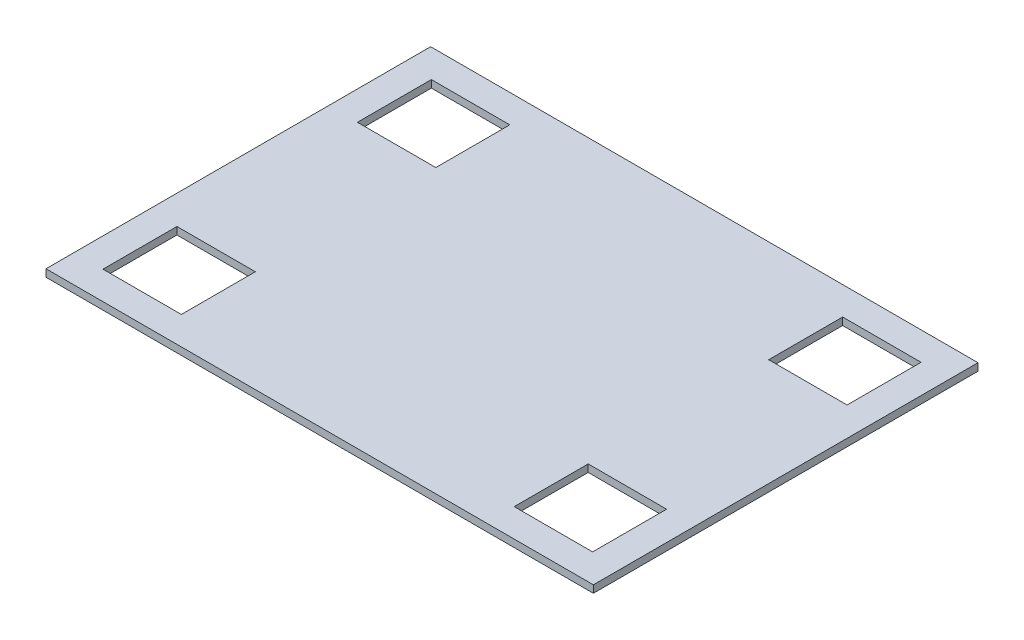
ISO-10303-21;
HEADER;
FILE_DESCRIPTION(('STEP AP214'),'2;1');
FILE_NAME('part.step','',(''),(''),'','','');
FILE_SCHEMA(('AUTOMOTIVE_DESIGN { 1 0 10303 214 1 1 1 1 }'));
ENDSEC;
DATA;
#1=APPLICATION_CONTEXT('core data for automotive mechanical design processes');
#2=APPLICATION_PROTOCOL_DEFINITION('international standard','automotive_design',2000,#1);
#3=PRODUCT_CONTEXT('',#1,'mechanical');
#4=PRODUCT('Part','Part','',(#3));
#5=PRODUCT_RELATED_PRODUCT_CATEGORY('part','',(#4));
#6=PRODUCT_DEFINITION_FORMATION('','',#4);
#7=PRODUCT_DEFINITION_CONTEXT('part definition',#1,'design');
#8=PRODUCT_DEFINITION('design','',#6,#7);
#9=PRODUCT_DEFINITION_SHAPE('','',#8);
#10=(LENGTH_UNIT() NAMED_UNIT(*) SI_UNIT(.MILLI.,.METRE.));
#11=(NAMED_UNIT(*) PLANE_ANGLE_UNIT() SI_UNIT($,.RADIAN.));
#12=(NAMED_UNIT(*) SI_UNIT($,.STERADIAN.) SOLID_ANGLE_UNIT());
#13=UNCERTAINTY_MEASURE_WITH_UNIT(LENGTH_MEASURE(1.E-05),#10,'distance_accuracy_value','');
#14=(GEOMETRIC_REPRESENTATION_CONTEXT(3) GLOBAL_UNCERTAINTY_ASSIGNED_CONTEXT((#13)) GLOBAL_UNIT_ASSIGNED_CONTEXT((#10,
#11,#12)) REPRESENTATION_CONTEXT('',''));
#15=CARTESIAN_POINT('',(0.,0.,0.));
#16=DIRECTION('',(0.,0.,1.));
#17=DIRECTION('',(1.,0.,0.));
#18=AXIS2_PLACEMENT_3D('',#15,#16,#17);
#19=CARTESIAN_POINT('',(0.,5.,0.));
#20=DIRECTION('',(0.,1.,0.));
#21=DIRECTION('',(0.,0.,1.));
#22=AXIS2_PLACEMENT_3D('',#19,#20,#21);
#23=PLANE('',#22);
#24=DIRECTION('',(1.,0.,0.));
#25=VECTOR('',#24,1.);
#26=CARTESIAN_POINT('',(0.,5.,111.));
#27=LINE('',#26,#25);
#28=CARTESIAN_POINT('',(-165.5,5.,111.));
#29=VERTEX_POINT('',#28);
#30=CARTESIAN_POINT('',(-112.5,5.,111.));
#31=VERTEX_POINT('',#30);
#32=EDGE_CURVE('E322',#29,#31,#27,.T.);
#33=ORIENTED_EDGE('',*,*,#32,.F.);
#34=DIRECTION('',(0.,0.,1.));
#35=VECTOR('',#34,1.);
#36=CARTESIAN_POINT('',(-165.5,5.,0.));
#37=LINE('',#36,#35);
#38=CARTESIAN_POINT('',(-165.5,5.,61.));
#39=VERTEX_POINT('',#38);
#40=EDGE_CURVE('E303',#39,#29,#37,.T.);
#41=ORIENTED_EDGE('',*,*,#40,.F.);
#42=DIRECTION('',(1.,0.,0.));
#43=VECTOR('',#42,1.);
#44=CARTESIAN_POINT('',(0.,5.,61.));
#45=LINE('',#44,#43);
#46=CARTESIAN_POINT('',(-112.5,5.,61.));
#47=VERTEX_POINT('',#46);
#48=EDGE_CURVE('E315',#39,#47,#45,.T.);
#49=ORIENTED_EDGE('',*,*,#48,.T.);
#50=DIRECTION('',(0.,0.,-1.));
#51=VECTOR('',#50,1.);
#52=CARTESIAN_POINT('',(-112.5,5.,0.));
#53=LINE('',#52,#51);
#54=EDGE_CURVE('E319',#31,#47,#53,.T.);
#55=ORIENTED_EDGE('',*,*,#54,.F.);
#56=EDGE_LOOP('',(#33,#41,#49,#55));
#57=FACE_BOUND('',#56,.T.);
#58=DIRECTION('',(0.,0.,-1.));
#59=VECTOR('',#58,1.);
#60=CARTESIAN_POINT('',(185.,5.,-130.));
#61=LINE('',#60,#59);
#62=CARTESIAN_POINT('',(185.,5.,130.));
#63=VERTEX_POINT('',#62);
#64=CARTESIAN_POINT('',(185.,5.,-130.));
#65=VERTEX_POINT('',#64);
#66=EDGE_CURVE('E368',#63,#65,#61,.T.);
#67=ORIENTED_EDGE('',*,*,#66,.T.);
#68=DIRECTION('',(-1.,0.,0.));
#69=VECTOR('',#68,1.);
#70=CARTESIAN_POINT('',(-185.,5.,-130.));
#71=LINE('',#70,#69);
#72=CARTESIAN_POINT('',(-185.,5.,-130.));
#73=VERTEX_POINT('',#72);
#74=EDGE_CURVE('E372',#65,#73,#71,.T.);
#75=ORIENTED_EDGE('',*,*,#74,.T.);
#76=DIRECTION('',(0.,0.,1.));
#77=VECTOR('',#76,1.);
#78=CARTESIAN_POINT('',(-185.,5.,-130.));
#79=LINE('',#78,#77);
#80=CARTESIAN_POINT('',(-185.,5.,130.));
#81=VERTEX_POINT('',#80);
#82=EDGE_CURVE('E376',#73,#81,#79,.T.);
#83=ORIENTED_EDGE('',*,*,#82,.T.);
#84=DIRECTION('',(1.,0.,0.));
#85=VECTOR('',#84,1.);
#86=CARTESIAN_POINT('',(-185.,5.,130.));
#87=LINE('',#86,#85);
#88=EDGE_CURVE('E379',#81,#63,#87,.T.);
#89=ORIENTED_EDGE('',*,*,#88,.T.);
#90=EDGE_LOOP('',(#67,#75,#83,#89));
#91=FACE_BOUND('',#90,.T.);
#92=DIRECTION('',(0.,0.,-1.));
#93=VECTOR('',#92,1.);
#94=CARTESIAN_POINT('',(165.5,5.,0.));
#95=LINE('',#94,#93);
#96=CARTESIAN_POINT('',(165.5,5.,-61.));
#97=VERTEX_POINT('',#96);
#98=CARTESIAN_POINT('',(165.5,5.,-111.));
#99=VERTEX_POINT('',#98);
#100=EDGE_CURVE('E330',#97,#99,#95,.T.);
#101=ORIENTED_EDGE('',*,*,#100,.F.);
#102=DIRECTION('',(-1.,0.,0.));
#103=VECTOR('',#102,1.);
#104=CARTESIAN_POINT('',(0.,5.,-61.));
#105=LINE('',#104,#103);
#106=CARTESIAN_POINT('',(112.5,5.,-61.));
#107=VERTEX_POINT('',#106);
#108=EDGE_CURVE('E333',#97,#107,#105,.T.);
#109=ORIENTED_EDGE('',*,*,#108,.T.);
#110=DIRECTION('',(0.,0.,1.));
#111=VECTOR('',#110,1.);
#112=CARTESIAN_POINT('',(112.5,5.,0.));
#113=LINE('',#112,#111);
#114=CARTESIAN_POINT('',(112.5,5.,-111.));
#115=VERTEX_POINT('',#114);
#116=EDGE_CURVE('E325',#115,#107,#113,.T.);
#117=ORIENTED_EDGE('',*,*,#116,.F.);
#118=DIRECTION('',(-1.,0.,0.));
#119=VECTOR('',#118,1.);
#120=CARTESIAN_POINT('',(0.,5.,-111.));
#121=LINE('',#120,#119);
#122=EDGE_CURVE('E194',#99,#115,#121,.T.);
#123=ORIENTED_EDGE('',*,*,#122,.F.);
#124=EDGE_LOOP('',(#101,#109,#117,#123));
#125=FACE_BOUND('',#124,.T.);
#126=DIRECTION('',(-1.,0.,0.));
#127=VECTOR('',#126,1.);
#128=CARTESIAN_POINT('',(0.,5.,111.));
#129=LINE('',#128,#127);
#130=CARTESIAN_POINT('',(165.5,5.,111.));
#131=VERTEX_POINT('',#130);
#132=CARTESIAN_POINT('',(112.5,5.,111.));
#133=VERTEX_POINT('',#132);
#134=EDGE_CURVE('E344',#131,#133,#129,.T.);
#135=ORIENTED_EDGE('',*,*,#134,.T.);
#136=DIRECTION('',(0.,0.,-1.));
#137=VECTOR('',#136,1.);
#138=CARTESIAN_POINT('',(112.5,5.,0.));
#139=LINE('',#138,#137);
#140=CARTESIAN_POINT('',(112.5,5.,61.));
#141=VERTEX_POINT('',#140);
#142=EDGE_CURVE('E348',#133,#141,#139,.T.);
#143=ORIENTED_EDGE('',*,*,#142,.T.);
#144=DIRECTION('',(-1.,0.,0.));
#145=VECTOR('',#144,1.);
#146=CARTESIAN_POINT('',(0.,5.,61.));
#147=LINE('',#146,#145);
#148=CARTESIAN_POINT('',(165.5,5.,61.));
#149=VERTEX_POINT('',#148);
#150=EDGE_CURVE('E337',#149,#141,#147,.T.);
#151=ORIENTED_EDGE('',*,*,#150,.F.);
#152=DIRECTION('',(0.,0.,1.));
#153=VECTOR('',#152,1.);
#154=CARTESIAN_POINT('',(165.5,5.,0.));
#155=LINE('',#154,#153);
#156=EDGE_CURVE('E340',#149,#131,#155,.T.);
#157=ORIENTED_EDGE('',*,*,#156,.T.);
#158=EDGE_LOOP('',(#135,#143,#151,#157));
#159=FACE_BOUND('',#158,.T.);
#160=DIRECTION('',(1.,0.,0.));
#161=VECTOR('',#160,1.);
#162=CARTESIAN_POINT('',(0.,5.,-111.));
#163=LINE('',#162,#161);
#164=CARTESIAN_POINT('',(-165.5,5.,-111.));
#165=VERTEX_POINT('',#164);
#166=CARTESIAN_POINT('',(-112.5,5.,-111.));
#167=VERTEX_POINT('',#166);
#168=EDGE_CURVE('E359',#165,#167,#163,.T.);
#169=ORIENTED_EDGE('',*,*,#168,.T.);
#170=DIRECTION('',(0.,0.,1.));
#171=VECTOR('',#170,1.);
#172=CARTESIAN_POINT('',(-112.5,5.,0.));
#173=LINE('',#172,#171);
#174=CARTESIAN_POINT('',(-112.5,5.,-61.));
#175=VERTEX_POINT('',#174);
#176=EDGE_CURVE('E363',#167,#175,#173,.T.);
#177=ORIENTED_EDGE('',*,*,#176,.T.);
#178=DIRECTION('',(1.,0.,0.));
#179=VECTOR('',#178,1.);
#180=CARTESIAN_POINT('',(0.,5.,-61.));
#181=LINE('',#180,#179);
#182=CARTESIAN_POINT('',(-165.5,5.,-61.));
#183=VERTEX_POINT('',#182);
#184=EDGE_CURVE('E352',#183,#175,#181,.T.);
#185=ORIENTED_EDGE('',*,*,#184,.F.);
#186=DIRECTION('',(0.,0.,-1.));
#187=VECTOR('',#186,1.);
#188=CARTESIAN_POINT('',(-165.5,5.,0.));
#189=LINE('',#188,#187);
#190=EDGE_CURVE('E355',#183,#165,#189,.T.);
#191=ORIENTED_EDGE('',*,*,#190,.T.);
#192=EDGE_LOOP('',(#169,#177,#185,#191));
#193=FACE_BOUND('',#192,.T.);
#194=ADVANCED_FACE('F48',(#57,#91,#125,#159,#193),#23,.T.);
#195=CARTESIAN_POINT('',(0.,0.,0.));
#196=DIRECTION('',(0.,1.,0.));
#197=DIRECTION('',(0.,0.,1.));
#198=AXIS2_PLACEMENT_3D('',#195,#196,#197);
#199=PLANE('',#198);
#200=DIRECTION('',(0.,0.,1.));
#201=VECTOR('',#200,1.);
#202=CARTESIAN_POINT('',(112.5,0.,0.));
#203=LINE('',#202,#201);
#204=CARTESIAN_POINT('',(112.5,0.,61.));
#205=VERTEX_POINT('',#204);
#206=CARTESIAN_POINT('',(112.5,0.,111.));
#207=VERTEX_POINT('',#206);
#208=EDGE_CURVE('E226',#205,#207,#203,.T.);
#209=ORIENTED_EDGE('',*,*,#208,.T.);
#210=DIRECTION('',(1.,0.,0.));
#211=VECTOR('',#210,1.);
#212=CARTESIAN_POINT('',(0.,0.,111.));
#213=LINE('',#212,#211);
#214=CARTESIAN_POINT('',(165.5,0.,111.));
#215=VERTEX_POINT('',#214);
#216=EDGE_CURVE('E270',#207,#215,#213,.T.);
#217=ORIENTED_EDGE('',*,*,#216,.T.);
#218=DIRECTION('',(0.,0.,-1.));
#219=VECTOR('',#218,1.);
#220=CARTESIAN_POINT('',(165.5,0.,0.));
#221=LINE('',#220,#219);
#222=CARTESIAN_POINT('',(165.5,0.,61.));
#223=VERTEX_POINT('',#222);
#224=EDGE_CURVE('E266',#215,#223,#221,.T.);
#225=ORIENTED_EDGE('',*,*,#224,.T.);
#226=DIRECTION('',(1.,0.,0.));
#227=VECTOR('',#226,1.);
#228=CARTESIAN_POINT('',(0.,0.,61.));
#229=LINE('',#228,#227);
#230=EDGE_CURVE('E263',#205,#223,#229,.T.);
#231=ORIENTED_EDGE('',*,*,#230,.F.);
#232=EDGE_LOOP('',(#209,#217,#225,#231));
#233=FACE_BOUND('',#232,.T.);
#234=DIRECTION('',(0.,0.,-1.));
#235=VECTOR('',#234,1.);
#236=CARTESIAN_POINT('',(185.,0.,-130.));
#237=LINE('',#236,#235);
#238=CARTESIAN_POINT('',(185.,0.,130.));
#239=VERTEX_POINT('',#238);
#240=CARTESIAN_POINT('',(185.,0.,-130.));
#241=VERTEX_POINT('',#240);
#242=EDGE_CURVE('E367',#239,#241,#237,.T.);
#243=ORIENTED_EDGE('',*,*,#242,.F.);
#244=DIRECTION('',(1.,0.,0.));
#245=VECTOR('',#244,1.);
#246=CARTESIAN_POINT('',(-185.,0.,130.));
#247=LINE('',#246,#245);
#248=CARTESIAN_POINT('',(-185.,0.,130.));
#249=VERTEX_POINT('',#248);
#250=EDGE_CURVE('E373',#249,#239,#247,.T.);
#251=ORIENTED_EDGE('',*,*,#250,.F.);
#252=DIRECTION('',(0.,0.,1.));
#253=VECTOR('',#252,1.);
#254=CARTESIAN_POINT('',(-185.,0.,-130.));
#255=LINE('',#254,#253);
#256=CARTESIAN_POINT('',(-185.,0.,-130.));
#257=VERTEX_POINT('',#256);
#258=EDGE_CURVE('E389',#257,#249,#255,.T.);
#259=ORIENTED_EDGE('',*,*,#258,.F.);
#260=DIRECTION('',(-1.,0.,0.));
#261=VECTOR('',#260,1.);
#262=CARTESIAN_POINT('',(-185.,0.,-130.));
#263=LINE('',#262,#261);
#264=EDGE_CURVE('E386',#241,#257,#263,.T.);
#265=ORIENTED_EDGE('',*,*,#264,.F.);
#266=EDGE_LOOP('',(#243,#251,#259,#265));
#267=FACE_BOUND('',#266,.T.);
#268=DIRECTION('',(0.,0.,-1.));
#269=VECTOR('',#268,1.);
#270=CARTESIAN_POINT('',(-165.5,0.,0.));
#271=LINE('',#270,#269);
#272=CARTESIAN_POINT('',(-165.5,0.,111.));
#273=VERTEX_POINT('',#272);
#274=CARTESIAN_POINT('',(-165.5,0.,61.));
#275=VERTEX_POINT('',#274);
#276=EDGE_CURVE('E287',#273,#275,#271,.T.);
#277=ORIENTED_EDGE('',*,*,#276,.F.);
#278=DIRECTION('',(-1.,0.,0.));
#279=VECTOR('',#278,1.);
#280=CARTESIAN_POINT('',(0.,0.,111.));
#281=LINE('',#280,#279);
#282=CARTESIAN_POINT('',(-112.5,0.,111.));
#283=VERTEX_POINT('',#282);
#284=EDGE_CURVE('E251',#283,#273,#281,.T.);
#285=ORIENTED_EDGE('',*,*,#284,.F.);
#286=DIRECTION('',(0.,0.,1.));
#287=VECTOR('',#286,1.);
#288=CARTESIAN_POINT('',(-112.5,0.,0.));
#289=LINE('',#288,#287);
#290=CARTESIAN_POINT('',(-112.5,0.,61.));
#291=VERTEX_POINT('',#290);
#292=EDGE_CURVE('E295',#291,#283,#289,.T.);
#293=ORIENTED_EDGE('',*,*,#292,.F.);
#294=DIRECTION('',(-1.,0.,0.));
#295=VECTOR('',#294,1.);
#296=CARTESIAN_POINT('',(0.,0.,61.));
#297=LINE('',#296,#295);
#298=EDGE_CURVE('E291',#291,#275,#297,.T.);
#299=ORIENTED_EDGE('',*,*,#298,.T.);
#300=EDGE_LOOP('',(#277,#285,#293,#299));
#301=FACE_BOUND('',#300,.T.);
#302=DIRECTION('',(1.,0.,0.));
#303=VECTOR('',#302,1.);
#304=CARTESIAN_POINT('',(0.,0.,-61.));
#305=LINE('',#304,#303);
#306=CARTESIAN_POINT('',(112.5,0.,-61.));
#307=VERTEX_POINT('',#306);
#308=CARTESIAN_POINT('',(165.5,0.,-61.));
#309=VERTEX_POINT('',#308);
#310=EDGE_CURVE('E209',#307,#309,#305,.T.);
#311=ORIENTED_EDGE('',*,*,#310,.T.);
#312=DIRECTION('',(0.,0.,1.));
#313=VECTOR('',#312,1.);
#314=CARTESIAN_POINT('',(165.5,0.,0.));
#315=LINE('',#314,#313);
#316=CARTESIAN_POINT('',(165.5,0.,-111.));
#317=VERTEX_POINT('',#316);
#318=EDGE_CURVE('E214',#317,#309,#315,.T.);
#319=ORIENTED_EDGE('',*,*,#318,.F.);
#320=DIRECTION('',(1.,0.,0.));
#321=VECTOR('',#320,1.);
#322=CARTESIAN_POINT('',(0.,0.,-111.));
#323=LINE('',#322,#321);
#324=CARTESIAN_POINT('',(112.5,0.,-111.));
#325=VERTEX_POINT('',#324);
#326=EDGE_CURVE('E191',#325,#317,#323,.T.);
#327=ORIENTED_EDGE('',*,*,#326,.F.);
#328=DIRECTION('',(0.,0.,-1.));
#329=VECTOR('',#328,1.);
#330=CARTESIAN_POINT('',(112.5,0.,0.));
#331=LINE('',#330,#329);
#332=EDGE_CURVE('E203',#307,#325,#331,.T.);
#333=ORIENTED_EDGE('',*,*,#332,.F.);
#334=EDGE_LOOP('',(#311,#319,#327,#333));
#335=FACE_BOUND('',#334,.T.);
#336=DIRECTION('',(0.,0.,-1.));
#337=VECTOR('',#336,1.);
#338=CARTESIAN_POINT('',(-112.5,0.,0.));
#339=LINE('',#338,#337);
#340=CARTESIAN_POINT('',(-112.5,0.,-61.));
#341=VERTEX_POINT('',#340);
#342=CARTESIAN_POINT('',(-112.5,0.,-111.));
#343=VERTEX_POINT('',#342);
#344=EDGE_CURVE('E231',#341,#343,#339,.T.);
#345=ORIENTED_EDGE('',*,*,#344,.T.);
#346=DIRECTION('',(-1.,0.,0.));
#347=VECTOR('',#346,1.);
#348=CARTESIAN_POINT('',(0.,0.,-111.));
#349=LINE('',#348,#347);
#350=CARTESIAN_POINT('',(-165.5,0.,-111.));
#351=VERTEX_POINT('',#350);
#352=EDGE_CURVE('E243',#343,#351,#349,.T.);
#353=ORIENTED_EDGE('',*,*,#352,.T.);
#354=DIRECTION('',(0.,0.,1.));
#355=VECTOR('',#354,1.);
#356=CARTESIAN_POINT('',(-165.5,0.,0.));
#357=LINE('',#356,#355);
#358=CARTESIAN_POINT('',(-165.5,0.,-61.));
#359=VERTEX_POINT('',#358);
#360=EDGE_CURVE('E239',#351,#359,#357,.T.);
#361=ORIENTED_EDGE('',*,*,#360,.T.);
#362=DIRECTION('',(-1.,0.,0.));
#363=VECTOR('',#362,1.);
#364=CARTESIAN_POINT('',(0.,0.,-61.));
#365=LINE('',#364,#363);
#366=EDGE_CURVE('E235',#341,#359,#365,.T.);
#367=ORIENTED_EDGE('',*,*,#366,.F.);
#368=EDGE_LOOP('',(#345,#353,#361,#367));
#369=FACE_BOUND('',#368,.T.);
#370=ADVANCED_FACE('F211',(#233,#267,#301,#335,#369),#199,.F.);
#371=CARTESIAN_POINT('',(185.,5.,-130.));
#372=DIRECTION('',(-1.,0.,0.));
#373=DIRECTION('',(0.,0.,1.));
#374=AXIS2_PLACEMENT_3D('',#371,#372,#373);
#375=PLANE('',#374);
#376=ORIENTED_EDGE('',*,*,#242,.T.);
#377=DIRECTION('',(0.,-1.,0.));
#378=VECTOR('',#377,1.);
#379=CARTESIAN_POINT('',(185.,5.,-130.));
#380=LINE('',#379,#378);
#381=EDGE_CURVE('E11',#65,#241,#380,.T.);
#382=ORIENTED_EDGE('',*,*,#381,.F.);
#383=ORIENTED_EDGE('',*,*,#66,.F.);
#384=DIRECTION('',(0.,-1.,0.));
#385=VECTOR('',#384,1.);
#386=CARTESIAN_POINT('',(185.,5.,130.));
#387=LINE('',#386,#385);
#388=EDGE_CURVE('E382',#63,#239,#387,.T.);
#389=ORIENTED_EDGE('',*,*,#388,.T.);
#390=EDGE_LOOP('',(#376,#382,#383,#389));
#391=FACE_BOUND('',#390,.T.);
#392=ADVANCED_FACE('F50',(#391),#375,.F.);
#393=CARTESIAN_POINT('',(-185.,5.,-130.));
#394=DIRECTION('',(0.,0.,1.));
#395=DIRECTION('',(1.,0.,0.));
#396=AXIS2_PLACEMENT_3D('',#393,#394,#395);
#397=PLANE('',#396);
#398=ORIENTED_EDGE('',*,*,#264,.T.);
#399=DIRECTION('',(0.,-1.,0.));
#400=VECTOR('',#399,1.);
#401=CARTESIAN_POINT('',(-185.,5.,-130.));
#402=LINE('',#401,#400);
#403=EDGE_CURVE('E57',#73,#257,#402,.T.);
#404=ORIENTED_EDGE('',*,*,#403,.F.);
#405=ORIENTED_EDGE('',*,*,#74,.F.);
#406=ORIENTED_EDGE('',*,*,#381,.T.);
#407=EDGE_LOOP('',(#398,#404,#405,#406));
#408=FACE_BOUND('',#407,.T.);
#409=ADVANCED_FACE('F424',(#408),#397,.F.);
#410=CARTESIAN_POINT('',(-185.,5.,-130.));
#411=DIRECTION('',(1.,0.,0.));
#412=DIRECTION('',(0.,0.,-1.));
#413=AXIS2_PLACEMENT_3D('',#410,#411,#412);
#414=PLANE('',#413);
#415=ORIENTED_EDGE('',*,*,#258,.T.);
#416=DIRECTION('',(0.,-1.,0.));
#417=VECTOR('',#416,1.);
#418=CARTESIAN_POINT('',(-185.,5.,130.));
#419=LINE('',#418,#417);
#420=EDGE_CURVE('E397',#81,#249,#419,.T.);
#421=ORIENTED_EDGE('',*,*,#420,.F.);
#422=ORIENTED_EDGE('',*,*,#82,.F.);
#423=ORIENTED_EDGE('',*,*,#403,.T.);
#424=EDGE_LOOP('',(#415,#421,#422,#423));
#425=FACE_BOUND('',#424,.T.);
#426=ADVANCED_FACE('F408',(#425),#414,.F.);
#427=CARTESIAN_POINT('',(-185.,5.,130.));
#428=DIRECTION('',(0.,0.,-1.));
#429=DIRECTION('',(-1.,0.,0.));
#430=AXIS2_PLACEMENT_3D('',#427,#428,#429);
#431=PLANE('',#430);
#432=ORIENTED_EDGE('',*,*,#250,.T.);
#433=ORIENTED_EDGE('',*,*,#388,.F.);
#434=ORIENTED_EDGE('',*,*,#88,.F.);
#435=ORIENTED_EDGE('',*,*,#420,.T.);
#436=EDGE_LOOP('',(#432,#433,#434,#435));
#437=FACE_BOUND('',#436,.T.);
#438=ADVANCED_FACE('F417',(#437),#431,.F.);
#439=CARTESIAN_POINT('',(0.,10.,111.));
#440=DIRECTION('',(0.,0.,1.));
#441=DIRECTION('',(1.,0.,0.));
#442=AXIS2_PLACEMENT_3D('',#439,#440,#441);
#443=PLANE('',#442);
#444=ORIENTED_EDGE('',*,*,#32,.T.);
#445=DIRECTION('',(0.,-1.,0.));
#446=VECTOR('',#445,1.);
#447=CARTESIAN_POINT('',(-112.5,10.,111.));
#448=LINE('',#447,#446);
#449=EDGE_CURVE('E300',#31,#283,#448,.T.);
#450=ORIENTED_EDGE('',*,*,#449,.T.);
#451=ORIENTED_EDGE('',*,*,#284,.T.);
#452=DIRECTION('',(0.,-1.,0.));
#453=VECTOR('',#452,1.);
#454=CARTESIAN_POINT('',(-165.5,10.,111.));
#455=LINE('',#454,#453);
#456=EDGE_CURVE('E299',#29,#273,#455,.T.);
#457=ORIENTED_EDGE('',*,*,#456,.F.);
#458=EDGE_LOOP('',(#444,#450,#451,#457));
#459=FACE_BOUND('',#458,.T.);
#460=ADVANCED_FACE('F441',(#459),#443,.F.);
#461=CARTESIAN_POINT('',(-112.5,10.,0.));
#462=DIRECTION('',(1.,0.,0.));
#463=DIRECTION('',(0.,0.,-1.));
#464=AXIS2_PLACEMENT_3D('',#461,#462,#463);
#465=PLANE('',#464);
#466=ORIENTED_EDGE('',*,*,#54,.T.);
#467=DIRECTION('',(0.,-1.,0.));
#468=VECTOR('',#467,1.);
#469=CARTESIAN_POINT('',(-112.5,10.,61.));
#470=LINE('',#469,#468);
#471=EDGE_CURVE('E304',#47,#291,#470,.T.);
#472=ORIENTED_EDGE('',*,*,#471,.T.);
#473=ORIENTED_EDGE('',*,*,#292,.T.);
#474=ORIENTED_EDGE('',*,*,#449,.F.);
#475=EDGE_LOOP('',(#466,#472,#473,#474));
#476=FACE_BOUND('',#475,.T.);
#477=ADVANCED_FACE('F448',(#476),#465,.F.);
#478=CARTESIAN_POINT('',(0.,10.,61.));
#479=DIRECTION('',(0.,0.,1.));
#480=DIRECTION('',(1.,0.,0.));
#481=AXIS2_PLACEMENT_3D('',#478,#479,#480);
#482=PLANE('',#481);
#483=DIRECTION('',(0.,-1.,0.));
#484=VECTOR('',#483,1.);
#485=CARTESIAN_POINT('',(-165.5,10.,61.));
#486=LINE('',#485,#484);
#487=EDGE_CURVE('E307',#39,#275,#486,.T.);
#488=ORIENTED_EDGE('',*,*,#487,.T.);
#489=ORIENTED_EDGE('',*,*,#298,.F.);
#490=ORIENTED_EDGE('',*,*,#471,.F.);
#491=ORIENTED_EDGE('',*,*,#48,.F.);
#492=EDGE_LOOP('',(#488,#489,#490,#491));
#493=FACE_BOUND('',#492,.T.);
#494=ADVANCED_FACE('F453',(#493),#482,.T.);
#495=CARTESIAN_POINT('',(-165.5,10.,0.));
#496=DIRECTION('',(-1.,0.,0.));
#497=DIRECTION('',(0.,0.,1.));
#498=AXIS2_PLACEMENT_3D('',#495,#496,#497);
#499=PLANE('',#498);
#500=ORIENTED_EDGE('',*,*,#40,.T.);
#501=ORIENTED_EDGE('',*,*,#456,.T.);
#502=ORIENTED_EDGE('',*,*,#276,.T.);
#503=ORIENTED_EDGE('',*,*,#487,.F.);
#504=EDGE_LOOP('',(#500,#501,#502,#503));
#505=FACE_BOUND('',#504,.T.);
#506=ADVANCED_FACE('F468',(#505),#499,.F.);
#507=CARTESIAN_POINT('',(0.,10.,-61.));
#508=DIRECTION('',(0.,0.,-1.));
#509=DIRECTION('',(-1.,0.,0.));
#510=AXIS2_PLACEMENT_3D('',#507,#508,#509);
#511=PLANE('',#510);
#512=DIRECTION('',(0.,-1.,0.));
#513=VECTOR('',#512,1.);
#514=CARTESIAN_POINT('',(165.5,10.,-61.));
#515=LINE('',#514,#513);
#516=EDGE_CURVE('E223',#97,#309,#515,.T.);
#517=ORIENTED_EDGE('',*,*,#516,.T.);
#518=ORIENTED_EDGE('',*,*,#310,.F.);
#519=DIRECTION('',(0.,-1.,0.));
#520=VECTOR('',#519,1.);
#521=CARTESIAN_POINT('',(112.5,10.,-61.));
#522=LINE('',#521,#520);
#523=EDGE_CURVE('E199',#107,#307,#522,.T.);
#524=ORIENTED_EDGE('',*,*,#523,.F.);
#525=ORIENTED_EDGE('',*,*,#108,.F.);
#526=EDGE_LOOP('',(#517,#518,#524,#525));
#527=FACE_BOUND('',#526,.T.);
#528=ADVANCED_FACE('F470',(#527),#511,.T.);
#529=CARTESIAN_POINT('',(165.5,10.,0.));
#530=DIRECTION('',(1.,0.,0.));
#531=DIRECTION('',(0.,0.,-1.));
#532=AXIS2_PLACEMENT_3D('',#529,#530,#531);
#533=PLANE('',#532);
#534=ORIENTED_EDGE('',*,*,#100,.T.);
#535=DIRECTION('',(0.,-1.,0.));
#536=VECTOR('',#535,1.);
#537=CARTESIAN_POINT('',(165.5,10.,-111.));
#538=LINE('',#537,#536);
#539=EDGE_CURVE('E198',#99,#317,#538,.T.);
#540=ORIENTED_EDGE('',*,*,#539,.T.);
#541=ORIENTED_EDGE('',*,*,#318,.T.);
#542=ORIENTED_EDGE('',*,*,#516,.F.);
#543=EDGE_LOOP('',(#534,#540,#541,#542));
#544=FACE_BOUND('',#543,.T.);
#545=ADVANCED_FACE('F475',(#544),#533,.F.);
#546=CARTESIAN_POINT('',(0.,10.,-111.));
#547=DIRECTION('',(0.,0.,-1.));
#548=DIRECTION('',(-1.,0.,0.));
#549=AXIS2_PLACEMENT_3D('',#546,#547,#548);
#550=PLANE('',#549);
#551=ORIENTED_EDGE('',*,*,#122,.T.);
#552=DIRECTION('',(0.,-1.,0.));
#553=VECTOR('',#552,1.);
#554=CARTESIAN_POINT('',(112.5,10.,-111.));
#555=LINE('',#554,#553);
#556=EDGE_CURVE('E186',#115,#325,#555,.T.);
#557=ORIENTED_EDGE('',*,*,#556,.T.);
#558=ORIENTED_EDGE('',*,*,#326,.T.);
#559=ORIENTED_EDGE('',*,*,#539,.F.);
#560=EDGE_LOOP('',(#551,#557,#558,#559));
#561=FACE_BOUND('',#560,.T.);
#562=ADVANCED_FACE('F188',(#561),#550,.F.);
#563=CARTESIAN_POINT('',(112.5,10.,0.));
#564=DIRECTION('',(-1.,0.,0.));
#565=DIRECTION('',(0.,0.,1.));
#566=AXIS2_PLACEMENT_3D('',#563,#564,#565);
#567=PLANE('',#566);
#568=ORIENTED_EDGE('',*,*,#116,.T.);
#569=ORIENTED_EDGE('',*,*,#523,.T.);
#570=ORIENTED_EDGE('',*,*,#332,.T.);
#571=ORIENTED_EDGE('',*,*,#556,.F.);
#572=EDGE_LOOP('',(#568,#569,#570,#571));
#573=FACE_BOUND('',#572,.T.);
#574=ADVANCED_FACE('F204',(#573),#567,.F.);
#575=CARTESIAN_POINT('',(112.5,10.,0.));
#576=DIRECTION('',(1.,0.,0.));
#577=DIRECTION('',(0.,0.,-1.));
#578=AXIS2_PLACEMENT_3D('',#575,#576,#577);
#579=PLANE('',#578);
#580=DIRECTION('',(0.,-1.,0.));
#581=VECTOR('',#580,1.);
#582=CARTESIAN_POINT('',(112.5,10.,111.));
#583=LINE('',#582,#581);
#584=EDGE_CURVE('E236',#133,#207,#583,.T.);
#585=ORIENTED_EDGE('',*,*,#584,.T.);
#586=ORIENTED_EDGE('',*,*,#208,.F.);
#587=DIRECTION('',(0.,-1.,0.));
#588=VECTOR('',#587,1.);
#589=CARTESIAN_POINT('',(112.5,10.,61.));
#590=LINE('',#589,#588);
#591=EDGE_CURVE('E274',#141,#205,#590,.T.);
#592=ORIENTED_EDGE('',*,*,#591,.F.);
#593=ORIENTED_EDGE('',*,*,#142,.F.);
#594=EDGE_LOOP('',(#585,#586,#592,#593));
#595=FACE_BOUND('',#594,.T.);
#596=ADVANCED_FACE('F480',(#595),#579,.T.);
#597=CARTESIAN_POINT('',(0.,10.,111.));
#598=DIRECTION('',(0.,0.,-1.));
#599=DIRECTION('',(-1.,0.,0.));
#600=AXIS2_PLACEMENT_3D('',#597,#598,#599);
#601=PLANE('',#600);
#602=DIRECTION('',(0.,-1.,0.));
#603=VECTOR('',#602,1.);
#604=CARTESIAN_POINT('',(165.5,10.,111.));
#605=LINE('',#604,#603);
#606=EDGE_CURVE('E277',#131,#215,#605,.T.);
#607=ORIENTED_EDGE('',*,*,#606,.T.);
#608=ORIENTED_EDGE('',*,*,#216,.F.);
#609=ORIENTED_EDGE('',*,*,#584,.F.);
#610=ORIENTED_EDGE('',*,*,#134,.F.);
#611=EDGE_LOOP('',(#607,#608,#609,#610));
#612=FACE_BOUND('',#611,.T.);
#613=ADVANCED_FACE('F483',(#612),#601,.T.);
#614=CARTESIAN_POINT('',(165.5,10.,0.));
#615=DIRECTION('',(-1.,0.,0.));
#616=DIRECTION('',(0.,0.,1.));
#617=AXIS2_PLACEMENT_3D('',#614,#615,#616);
#618=PLANE('',#617);
#619=DIRECTION('',(0.,-1.,0.));
#620=VECTOR('',#619,1.);
#621=CARTESIAN_POINT('',(165.5,10.,61.));
#622=LINE('',#621,#620);
#623=EDGE_CURVE('E72',#149,#223,#622,.T.);
#624=ORIENTED_EDGE('',*,*,#623,.T.);
#625=ORIENTED_EDGE('',*,*,#224,.F.);
#626=ORIENTED_EDGE('',*,*,#606,.F.);
#627=ORIENTED_EDGE('',*,*,#156,.F.);
#628=EDGE_LOOP('',(#624,#625,#626,#627));
#629=FACE_BOUND('',#628,.T.);
#630=ADVANCED_FACE('F489',(#629),#618,.T.);
#631=CARTESIAN_POINT('',(0.,10.,61.));
#632=DIRECTION('',(0.,0.,-1.));
#633=DIRECTION('',(-1.,0.,0.));
#634=AXIS2_PLACEMENT_3D('',#631,#632,#633);
#635=PLANE('',#634);
#636=ORIENTED_EDGE('',*,*,#150,.T.);
#637=ORIENTED_EDGE('',*,*,#591,.T.);
#638=ORIENTED_EDGE('',*,*,#230,.T.);
#639=ORIENTED_EDGE('',*,*,#623,.F.);
#640=EDGE_LOOP('',(#636,#637,#638,#639));
#641=FACE_BOUND('',#640,.T.);
#642=ADVANCED_FACE('F485',(#641),#635,.F.);
#643=CARTESIAN_POINT('',(-112.5,10.,0.));
#644=DIRECTION('',(-1.,0.,0.));
#645=DIRECTION('',(0.,0.,1.));
#646=AXIS2_PLACEMENT_3D('',#643,#644,#645);
#647=PLANE('',#646);
#648=DIRECTION('',(0.,-1.,0.));
#649=VECTOR('',#648,1.);
#650=CARTESIAN_POINT('',(-112.5,10.,-111.));
#651=LINE('',#650,#649);
#652=EDGE_CURVE('E248',#167,#343,#651,.T.);
#653=ORIENTED_EDGE('',*,*,#652,.T.);
#654=ORIENTED_EDGE('',*,*,#344,.F.);
#655=DIRECTION('',(0.,-1.,0.));
#656=VECTOR('',#655,1.);
#657=CARTESIAN_POINT('',(-112.5,10.,-61.));
#658=LINE('',#657,#656);
#659=EDGE_CURVE('E247',#175,#341,#658,.T.);
#660=ORIENTED_EDGE('',*,*,#659,.F.);
#661=ORIENTED_EDGE('',*,*,#176,.F.);
#662=EDGE_LOOP('',(#653,#654,#660,#661));
#663=FACE_BOUND('',#662,.T.);
#664=ADVANCED_FACE('F488',(#663),#647,.T.);
#665=CARTESIAN_POINT('',(0.,10.,-111.));
#666=DIRECTION('',(0.,0.,1.));
#667=DIRECTION('',(1.,0.,0.));
#668=AXIS2_PLACEMENT_3D('',#665,#666,#667);
#669=PLANE('',#668);
#670=DIRECTION('',(0.,-1.,0.));
#671=VECTOR('',#670,1.);
#672=CARTESIAN_POINT('',(-165.5,10.,-111.));
#673=LINE('',#672,#671);
#674=EDGE_CURVE('E252',#165,#351,#673,.T.);
#675=ORIENTED_EDGE('',*,*,#674,.T.);
#676=ORIENTED_EDGE('',*,*,#352,.F.);
#677=ORIENTED_EDGE('',*,*,#652,.F.);
#678=ORIENTED_EDGE('',*,*,#168,.F.);
#679=EDGE_LOOP('',(#675,#676,#677,#678));
#680=FACE_BOUND('',#679,.T.);
#681=ADVANCED_FACE('F498',(#680),#669,.T.);
#682=CARTESIAN_POINT('',(-165.5,10.,0.));
#683=DIRECTION('',(1.,0.,0.));
#684=DIRECTION('',(0.,0.,-1.));
#685=AXIS2_PLACEMENT_3D('',#682,#683,#684);
#686=PLANE('',#685);
#687=DIRECTION('',(0.,-1.,0.));
#688=VECTOR('',#687,1.);
#689=CARTESIAN_POINT('',(-165.5,10.,-61.));
#690=LINE('',#689,#688);
#691=EDGE_CURVE('E64',#183,#359,#690,.T.);
#692=ORIENTED_EDGE('',*,*,#691,.T.);
#693=ORIENTED_EDGE('',*,*,#360,.F.);
#694=ORIENTED_EDGE('',*,*,#674,.F.);
#695=ORIENTED_EDGE('',*,*,#190,.F.);
#696=EDGE_LOOP('',(#692,#693,#694,#695));
#697=FACE_BOUND('',#696,.T.);
#698=ADVANCED_FACE('F503',(#697),#686,.T.);
#699=CARTESIAN_POINT('',(0.,10.,-61.));
#700=DIRECTION('',(0.,0.,1.));
#701=DIRECTION('',(1.,0.,0.));
#702=AXIS2_PLACEMENT_3D('',#699,#700,#701);
#703=PLANE('',#702);
#704=ORIENTED_EDGE('',*,*,#184,.T.);
#705=ORIENTED_EDGE('',*,*,#659,.T.);
#706=ORIENTED_EDGE('',*,*,#366,.T.);
#707=ORIENTED_EDGE('',*,*,#691,.F.);
#708=EDGE_LOOP('',(#704,#705,#706,#707));
#709=FACE_BOUND('',#708,.T.);
#710=ADVANCED_FACE('F500',(#709),#703,.F.);
#711=CLOSED_SHELL('',(#194,#370,#392,#409,#426,#438,#460,#477,#494,#506,#528,#545,#562,#574,
#596,#613,#630,#642,#664,#681,#698,#710));
#712=MANIFOLD_SOLID_BREP('B2',#711);
#713=ADVANCED_BREP_SHAPE_REPRESENTATION('',(#18,#712),#14);
#714=SHAPE_DEFINITION_REPRESENTATION(#9,#713);
ENDSEC;
END-ISO-10303-21;
